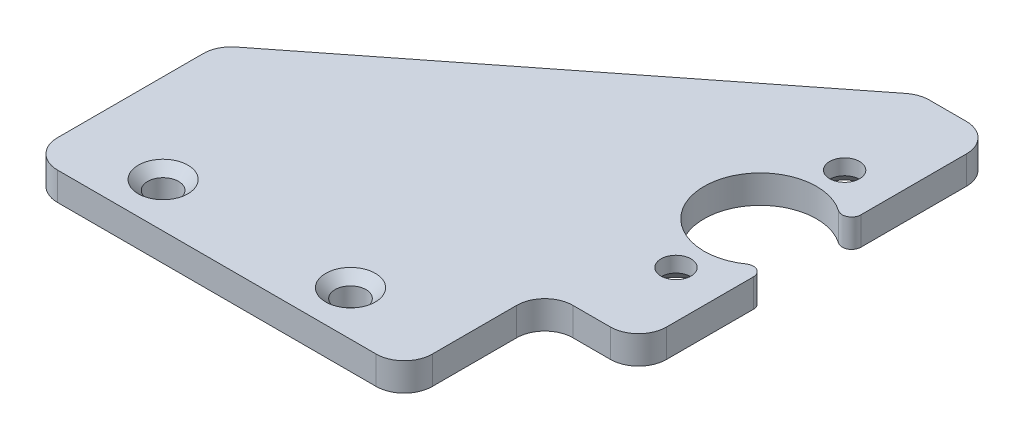
ISO-10303-21;
HEADER;
FILE_DESCRIPTION(('STEP AP214'),'2;1');
FILE_NAME('part.step','',(''),(''),'','','');
FILE_SCHEMA(('AUTOMOTIVE_DESIGN { 1 0 10303 214 1 1 1 1 }'));
ENDSEC;
DATA;
#1=APPLICATION_CONTEXT('core data for automotive mechanical design processes');
#2=APPLICATION_PROTOCOL_DEFINITION('international standard','automotive_design',2000,#1);
#3=PRODUCT_CONTEXT('',#1,'mechanical');
#4=PRODUCT('Part','Part','',(#3));
#5=PRODUCT_RELATED_PRODUCT_CATEGORY('part','',(#4));
#6=PRODUCT_DEFINITION_FORMATION('','',#4);
#7=PRODUCT_DEFINITION_CONTEXT('part definition',#1,'design');
#8=PRODUCT_DEFINITION('design','',#6,#7);
#9=PRODUCT_DEFINITION_SHAPE('','',#8);
#10=(LENGTH_UNIT() NAMED_UNIT(*) SI_UNIT(.MILLI.,.METRE.));
#11=(NAMED_UNIT(*) PLANE_ANGLE_UNIT() SI_UNIT($,.RADIAN.));
#12=(NAMED_UNIT(*) SI_UNIT($,.STERADIAN.) SOLID_ANGLE_UNIT());
#13=UNCERTAINTY_MEASURE_WITH_UNIT(LENGTH_MEASURE(1.E-05),#10,'distance_accuracy_value','');
#14=(GEOMETRIC_REPRESENTATION_CONTEXT(3) GLOBAL_UNCERTAINTY_ASSIGNED_CONTEXT((#13)) GLOBAL_UNIT_ASSIGNED_CONTEXT((#10,
#11,#12)) REPRESENTATION_CONTEXT('',''));
#15=CARTESIAN_POINT('',(0.,0.,0.));
#16=DIRECTION('',(0.,0.,1.));
#17=DIRECTION('',(1.,0.,0.));
#18=AXIS2_PLACEMENT_3D('',#15,#16,#17);
#19=CARTESIAN_POINT('',(0.,3.,-20.));
#20=DIRECTION('',(0.,0.,-1.));
#21=DIRECTION('',(-1.,0.,0.));
#22=AXIS2_PLACEMENT_3D('',#19,#20,#21);
#23=PLANE('',#22);
#24=DIRECTION('',(1.,0.,0.));
#25=VECTOR('',#24,1.);
#26=CARTESIAN_POINT('',(0.,3.,-20.));
#27=LINE('',#26,#25);
#28=CARTESIAN_POINT('',(18.0375892222086,3.,-20.));
#29=VERTEX_POINT('',#28);
#30=CARTESIAN_POINT('',(22.,3.,-20.));
#31=VERTEX_POINT('',#30);
#32=EDGE_CURVE('E406',#29,#31,#27,.T.);
#33=ORIENTED_EDGE('',*,*,#32,.T.);
#34=DIRECTION('',(0.,-1.,0.));
#35=VECTOR('',#34,1.);
#36=CARTESIAN_POINT('',(22.,3.,-20.));
#37=LINE('',#36,#35);
#38=CARTESIAN_POINT('',(22.,0.,-20.));
#39=VERTEX_POINT('',#38);
#40=EDGE_CURVE('E319',#31,#39,#37,.T.);
#41=ORIENTED_EDGE('',*,*,#40,.T.);
#42=DIRECTION('',(1.,0.,0.));
#43=VECTOR('',#42,1.);
#44=CARTESIAN_POINT('',(0.,0.,-20.));
#45=LINE('',#44,#43);
#46=CARTESIAN_POINT('',(18.0375892222086,0.,-20.));
#47=VERTEX_POINT('',#46);
#48=EDGE_CURVE('E182',#47,#39,#45,.T.);
#49=ORIENTED_EDGE('',*,*,#48,.F.);
#50=DIRECTION('',(0.,-1.,0.));
#51=VECTOR('',#50,1.);
#52=CARTESIAN_POINT('',(18.0375892222086,3.,-20.));
#53=LINE('',#52,#51);
#54=EDGE_CURVE('E316',#47,#29,#53,.F.);
#55=ORIENTED_EDGE('',*,*,#54,.T.);
#56=EDGE_LOOP('',(#33,#41,#49,#55));
#57=FACE_BOUND('',#56,.T.);
#58=ADVANCED_FACE('F43',(#57),#23,.T.);
#59=CARTESIAN_POINT('',(-25.,3.,0.));
#60=DIRECTION('',(-1.,0.,0.));
#61=DIRECTION('',(0.,0.,1.));
#62=AXIS2_PLACEMENT_3D('',#59,#60,#61);
#63=PLANE('',#62);
#64=DIRECTION('',(0.,0.,-1.));
#65=VECTOR('',#64,1.);
#66=CARTESIAN_POINT('',(-25.,3.,0.));
#67=LINE('',#66,#65);
#68=CARTESIAN_POINT('',(-25.,3.,30.));
#69=VERTEX_POINT('',#68);
#70=CARTESIAN_POINT('',(-25.,3.,14.4581058174496));
#71=VERTEX_POINT('',#70);
#72=EDGE_CURVE('E387',#69,#71,#67,.T.);
#73=ORIENTED_EDGE('',*,*,#72,.T.);
#74=DIRECTION('',(0.,-1.,0.));
#75=VECTOR('',#74,1.);
#76=CARTESIAN_POINT('',(-25.,3.,14.4581058174496));
#77=LINE('',#76,#75);
#78=CARTESIAN_POINT('',(-25.,0.,14.4581058174496));
#79=VERTEX_POINT('',#78);
#80=EDGE_CURVE('E260',#71,#79,#77,.T.);
#81=ORIENTED_EDGE('',*,*,#80,.T.);
#82=DIRECTION('',(0.,0.,-1.));
#83=VECTOR('',#82,1.);
#84=CARTESIAN_POINT('',(-25.,0.,0.));
#85=LINE('',#84,#83);
#86=CARTESIAN_POINT('',(-25.,0.,30.));
#87=VERTEX_POINT('',#86);
#88=EDGE_CURVE('E210',#87,#79,#85,.T.);
#89=ORIENTED_EDGE('',*,*,#88,.F.);
#90=DIRECTION('',(0.,-1.,0.));
#91=VECTOR('',#90,1.);
#92=CARTESIAN_POINT('',(-25.,3.,30.));
#93=LINE('',#92,#91);
#94=EDGE_CURVE('E257',#87,#69,#93,.F.);
#95=ORIENTED_EDGE('',*,*,#94,.T.);
#96=EDGE_LOOP('',(#73,#81,#89,#95));
#97=FACE_BOUND('',#96,.T.);
#98=ADVANCED_FACE('F385',(#97),#63,.T.);
#99=CARTESIAN_POINT('',(25.,3.,0.));
#100=DIRECTION('',(1.,0.,0.));
#101=DIRECTION('',(0.,0.,-1.));
#102=AXIS2_PLACEMENT_3D('',#99,#100,#101);
#103=PLANE('',#102);
#104=DIRECTION('',(0.,0.,1.));
#105=VECTOR('',#104,1.);
#106=CARTESIAN_POINT('',(25.,3.,0.));
#107=LINE('',#106,#105);
#108=CARTESIAN_POINT('',(25.,3.,5.74456264653803));
#109=VERTEX_POINT('',#108);
#110=CARTESIAN_POINT('',(25.,3.,15.));
#111=VERTEX_POINT('',#110);
#112=EDGE_CURVE('E403',#109,#111,#107,.T.);
#113=ORIENTED_EDGE('',*,*,#112,.T.);
#114=DIRECTION('',(0.,-1.,0.));
#115=VECTOR('',#114,1.);
#116=CARTESIAN_POINT('',(25.,3.,15.));
#117=LINE('',#116,#115);
#118=CARTESIAN_POINT('',(25.,0.,15.));
#119=VERTEX_POINT('',#118);
#120=EDGE_CURVE('E312',#111,#119,#117,.T.);
#121=ORIENTED_EDGE('',*,*,#120,.T.);
#122=DIRECTION('',(0.,0.,1.));
#123=VECTOR('',#122,1.);
#124=CARTESIAN_POINT('',(25.,0.,0.));
#125=LINE('',#124,#123);
#126=CARTESIAN_POINT('',(25.,0.,5.74456264653803));
#127=VERTEX_POINT('',#126);
#128=EDGE_CURVE('E185',#127,#119,#125,.T.);
#129=ORIENTED_EDGE('',*,*,#128,.F.);
#130=DIRECTION('',(0.,-1.,0.));
#131=VECTOR('',#130,1.);
#132=CARTESIAN_POINT('',(25.,3.,5.74456264653803));
#133=LINE('',#132,#131);
#134=EDGE_CURVE('E224',#127,#109,#133,.F.);
#135=ORIENTED_EDGE('',*,*,#134,.T.);
#136=EDGE_LOOP('',(#113,#121,#129,#135));
#137=FACE_BOUND('',#136,.T.);
#138=ADVANCED_FACE('F358',(#137),#103,.T.);
#139=CARTESIAN_POINT('',(0.,3.,0.));
#140=DIRECTION('',(0.,1.,0.));
#141=DIRECTION('',(0.,0.,1.));
#142=AXIS2_PLACEMENT_3D('',#139,#140,#141);
#143=PLANE('',#142);
#144=CARTESIAN_POINT('',(4.5,3.,28.234562646538));
#145=DIRECTION('',(0.,1.,0.));
#146=DIRECTION('',(0.,0.,1.));
#147=AXIS2_PLACEMENT_3D('',#144,#145,#146);
#148=CIRCLE('',#147,2.65000000000001);
#149=CARTESIAN_POINT('',(4.5,3.,30.884562646538));
#150=VERTEX_POINT('',#149);
#151=EDGE_CURVE('E335',#150,#150,#148,.F.);
#152=ORIENTED_EDGE('',*,*,#151,.T.);
#153=EDGE_LOOP('',(#152));
#154=FACE_BOUND('',#153,.T.);
#155=CARTESIAN_POINT('',(-15.5,3.,28.234562646538));
#156=DIRECTION('',(0.,1.,0.));
#157=DIRECTION('',(0.,0.,1.));
#158=AXIS2_PLACEMENT_3D('',#155,#156,#157);
#159=CIRCLE('',#158,2.65000000000001);
#160=CARTESIAN_POINT('',(-15.5,3.,30.884562646538));
#161=VERTEX_POINT('',#160);
#162=EDGE_CURVE('E331',#161,#161,#159,.F.);
#163=ORIENTED_EDGE('',*,*,#162,.T.);
#164=EDGE_LOOP('',(#163));
#165=FACE_BOUND('',#164,.T.);
#166=CARTESIAN_POINT('',(20.,3.,9.));
#167=DIRECTION('',(0.,1.,0.));
#168=DIRECTION('',(0.,0.,1.));
#169=AXIS2_PLACEMENT_3D('',#166,#167,#168);
#170=CIRCLE('',#169,1.6);
#171=CARTESIAN_POINT('',(20.,3.,10.6));
#172=VERTEX_POINT('',#171);
#173=EDGE_CURVE('E207',#172,#172,#170,.T.);
#174=ORIENTED_EDGE('',*,*,#173,.F.);
#175=EDGE_LOOP('',(#174));
#176=FACE_BOUND('',#175,.T.);
#177=CARTESIAN_POINT('',(20.,3.,-9.));
#178=DIRECTION('',(0.,1.,0.));
#179=DIRECTION('',(0.,0.,1.));
#180=AXIS2_PLACEMENT_3D('',#177,#178,#179);
#181=CIRCLE('',#180,1.6);
#182=CARTESIAN_POINT('',(20.,3.,-7.4));
#183=VERTEX_POINT('',#182);
#184=EDGE_CURVE('E201',#183,#183,#181,.T.);
#185=ORIENTED_EDGE('',*,*,#184,.F.);
#186=EDGE_LOOP('',(#185));
#187=FACE_BOUND('',#186,.T.);
#188=DIRECTION('',(0.786318338822423,0.,-0.617821551931904));
#189=VECTOR('',#188,1.);
#190=CARTESIAN_POINT('',(-25.,3.,13.));
#191=LINE('',#190,#189);
#192=CARTESIAN_POINT('',(-23.8534646557957,3.,12.0991508009823));
#193=VERTEX_POINT('',#192);
#194=CARTESIAN_POINT('',(16.1841245664129,3.,-19.3589550164673));
#195=VERTEX_POINT('',#194);
#196=EDGE_CURVE('E367',#193,#195,#191,.T.);
#197=ORIENTED_EDGE('',*,*,#196,.F.);
#198=CARTESIAN_POINT('',(-22.,3.,14.4581058174496));
#199=DIRECTION('',(0.,1.,0.));
#200=DIRECTION('',(0.,0.,1.));
#201=AXIS2_PLACEMENT_3D('',#198,#199,#200);
#202=CIRCLE('',#201,3.);
#203=EDGE_CURVE('E302',#193,#71,#202,.T.);
#204=ORIENTED_EDGE('',*,*,#203,.T.);
#205=ORIENTED_EDGE('',*,*,#72,.F.);
#206=CARTESIAN_POINT('',(-22.,3.,30.));
#207=DIRECTION('',(0.,1.,0.));
#208=DIRECTION('',(0.,0.,1.));
#209=AXIS2_PLACEMENT_3D('',#206,#207,#208);
#210=CIRCLE('',#209,3.);
#211=CARTESIAN_POINT('',(-22.,3.,33.));
#212=VERTEX_POINT('',#211);
#213=EDGE_CURVE('E299',#69,#212,#210,.T.);
#214=ORIENTED_EDGE('',*,*,#213,.T.);
#215=DIRECTION('',(-1.,0.,0.));
#216=VECTOR('',#215,1.);
#217=CARTESIAN_POINT('',(-25.,3.,33.));
#218=LINE('',#217,#216);
#219=CARTESIAN_POINT('',(12.,3.,33.));
#220=VERTEX_POINT('',#219);
#221=EDGE_CURVE('E399',#220,#212,#218,.T.);
#222=ORIENTED_EDGE('',*,*,#221,.F.);
#223=CARTESIAN_POINT('',(12.,3.,30.));
#224=DIRECTION('',(0.,1.,0.));
#225=DIRECTION('',(0.,0.,1.));
#226=AXIS2_PLACEMENT_3D('',#223,#224,#225);
#227=CIRCLE('',#226,3.);
#228=CARTESIAN_POINT('',(15.,3.,30.));
#229=VERTEX_POINT('',#228);
#230=EDGE_CURVE('E296',#220,#229,#227,.T.);
#231=ORIENTED_EDGE('',*,*,#230,.T.);
#232=DIRECTION('',(0.,0.,1.));
#233=VECTOR('',#232,1.);
#234=CARTESIAN_POINT('',(15.,3.,18.));
#235=LINE('',#234,#233);
#236=CARTESIAN_POINT('',(15.,3.,21.));
#237=VERTEX_POINT('',#236);
#238=EDGE_CURVE('E428',#237,#229,#235,.T.);
#239=ORIENTED_EDGE('',*,*,#238,.F.);
#240=CARTESIAN_POINT('',(18.,3.,21.));
#241=DIRECTION('',(0.,1.,0.));
#242=DIRECTION('',(0.,0.,1.));
#243=AXIS2_PLACEMENT_3D('',#240,#241,#242);
#244=CIRCLE('',#243,3.);
#245=CARTESIAN_POINT('',(18.,3.,18.));
#246=VERTEX_POINT('',#245);
#247=EDGE_CURVE('E328',#237,#246,#244,.F.);
#248=ORIENTED_EDGE('',*,*,#247,.T.);
#249=DIRECTION('',(-1.,0.,0.));
#250=VECTOR('',#249,1.);
#251=CARTESIAN_POINT('',(25.,3.,18.));
#252=LINE('',#251,#250);
#253=CARTESIAN_POINT('',(22.,3.,18.));
#254=VERTEX_POINT('',#253);
#255=EDGE_CURVE('E433',#254,#246,#252,.T.);
#256=ORIENTED_EDGE('',*,*,#255,.F.);
#257=CARTESIAN_POINT('',(22.,3.,15.));
#258=DIRECTION('',(0.,1.,0.));
#259=DIRECTION('',(0.,0.,1.));
#260=AXIS2_PLACEMENT_3D('',#257,#258,#259);
#261=CIRCLE('',#260,3.);
#262=EDGE_CURVE('E68',#254,#111,#261,.T.);
#263=ORIENTED_EDGE('',*,*,#262,.T.);
#264=ORIENTED_EDGE('',*,*,#112,.F.);
#265=CARTESIAN_POINT('',(24.,3.,5.74456264653803));
#266=DIRECTION('',(0.,1.,0.));
#267=DIRECTION('',(0.,0.,1.));
#268=AXIS2_PLACEMENT_3D('',#265,#266,#267);
#269=CIRCLE('',#268,1.);
#270=CARTESIAN_POINT('',(23.4285714285714,3.,4.92391083988974));
#271=VERTEX_POINT('',#270);
#272=EDGE_CURVE('E218',#109,#271,#269,.T.);
#273=ORIENTED_EDGE('',*,*,#272,.T.);
#274=CARTESIAN_POINT('',(20.,3.,0.));
#275=DIRECTION('',(0.,1.,0.));
#276=DIRECTION('',(0.,0.,1.));
#277=AXIS2_PLACEMENT_3D('',#274,#275,#276);
#278=CIRCLE('',#277,6.);
#279=CARTESIAN_POINT('',(23.4285714285714,3.,-4.92391083988974));
#280=VERTEX_POINT('',#279);
#281=EDGE_CURVE('E395',#280,#271,#278,.T.);
#282=ORIENTED_EDGE('',*,*,#281,.F.);
#283=CARTESIAN_POINT('',(24.,3.,-5.74456264653803));
#284=DIRECTION('',(0.,1.,0.));
#285=DIRECTION('',(0.,0.,1.));
#286=AXIS2_PLACEMENT_3D('',#283,#284,#285);
#287=CIRCLE('',#286,1.);
#288=CARTESIAN_POINT('',(25.,3.,-5.74456264653803));
#289=VERTEX_POINT('',#288);
#290=EDGE_CURVE('E221',#280,#289,#287,.T.);
#291=ORIENTED_EDGE('',*,*,#290,.T.);
#292=CARTESIAN_POINT('',(25.,3.,-17.));
#293=VERTEX_POINT('',#292);
#294=EDGE_CURVE('E198',#293,#289,#107,.T.);
#295=ORIENTED_EDGE('',*,*,#294,.F.);
#296=CARTESIAN_POINT('',(22.,3.,-17.));
#297=DIRECTION('',(0.,1.,0.));
#298=DIRECTION('',(0.,0.,1.));
#299=AXIS2_PLACEMENT_3D('',#296,#297,#298);
#300=CIRCLE('',#299,3.);
#301=EDGE_CURVE('E291',#293,#31,#300,.T.);
#302=ORIENTED_EDGE('',*,*,#301,.T.);
#303=ORIENTED_EDGE('',*,*,#32,.F.);
#304=CARTESIAN_POINT('',(18.0375892222086,3.,-17.));
#305=DIRECTION('',(0.,1.,0.));
#306=DIRECTION('',(0.,0.,1.));
#307=AXIS2_PLACEMENT_3D('',#304,#305,#306);
#308=CIRCLE('',#307,3.);
#309=EDGE_CURVE('E288',#29,#195,#308,.T.);
#310=ORIENTED_EDGE('',*,*,#309,.T.);
#311=EDGE_LOOP('',(#197,#204,#205,#214,#222,#231,#239,#248,#256,#263,#264,#273,#282,#291,#295,
#302,#303,#310));
#312=FACE_BOUND('',#311,.T.);
#313=ADVANCED_FACE('F355',(#154,#165,#176,#187,#312),#143,.T.);
#314=CARTESIAN_POINT('',(0.,0.,0.));
#315=DIRECTION('',(0.,1.,0.));
#316=DIRECTION('',(0.,0.,1.));
#317=AXIS2_PLACEMENT_3D('',#314,#315,#316);
#318=PLANE('',#317);
#319=CARTESIAN_POINT('',(-5.5,0.,10.234562646538));
#320=DIRECTION('',(0.,1.,0.));
#321=DIRECTION('',(0.,0.,1.));
#322=AXIS2_PLACEMENT_3D('',#319,#320,#321);
#323=CIRCLE('',#322,4.);
#324=CARTESIAN_POINT('',(-5.5,0.,14.234562646538));
#325=VERTEX_POINT('',#324);
#326=EDGE_CURVE('E11',#325,#325,#323,.F.);
#327=ORIENTED_EDGE('',*,*,#326,.F.);
#328=EDGE_LOOP('',(#327));
#329=FACE_BOUND('',#328,.T.);
#330=CARTESIAN_POINT('',(-15.5,0.,28.234562646538));
#331=DIRECTION('',(0.,-1.,0.));
#332=DIRECTION('',(0.,0.,-1.));
#333=AXIS2_PLACEMENT_3D('',#330,#331,#332);
#334=CIRCLE('',#333,1.65);
#335=CARTESIAN_POINT('',(-15.5,0.,26.584562646538));
#336=VERTEX_POINT('',#335);
#337=EDGE_CURVE('E418',#336,#336,#334,.T.);
#338=ORIENTED_EDGE('',*,*,#337,.F.);
#339=EDGE_LOOP('',(#338));
#340=FACE_BOUND('',#339,.T.);
#341=CARTESIAN_POINT('',(4.5,0.,28.234562646538));
#342=DIRECTION('',(0.,-1.,0.));
#343=DIRECTION('',(0.,0.,-1.));
#344=AXIS2_PLACEMENT_3D('',#341,#342,#343);
#345=CIRCLE('',#344,1.65);
#346=CARTESIAN_POINT('',(4.5,0.,26.584562646538));
#347=VERTEX_POINT('',#346);
#348=EDGE_CURVE('E376',#347,#347,#345,.T.);
#349=ORIENTED_EDGE('',*,*,#348,.F.);
#350=EDGE_LOOP('',(#349));
#351=FACE_BOUND('',#350,.T.);
#352=CARTESIAN_POINT('',(20.,0.,-9.));
#353=DIRECTION('',(0.,1.,0.));
#354=DIRECTION('',(0.,0.,1.));
#355=AXIS2_PLACEMENT_3D('',#352,#353,#354);
#356=CIRCLE('',#355,2.94999999999999);
#357=CARTESIAN_POINT('',(20.,0.,-6.05000000000001));
#358=VERTEX_POINT('',#357);
#359=EDGE_CURVE('E231',#358,#358,#356,.T.);
#360=ORIENTED_EDGE('',*,*,#359,.T.);
#361=EDGE_LOOP('',(#360));
#362=FACE_BOUND('',#361,.T.);
#363=CARTESIAN_POINT('',(20.,0.,9.));
#364=DIRECTION('',(0.,1.,0.));
#365=DIRECTION('',(0.,0.,1.));
#366=AXIS2_PLACEMENT_3D('',#363,#364,#365);
#367=CIRCLE('',#366,2.95);
#368=CARTESIAN_POINT('',(20.,0.,11.95));
#369=VERTEX_POINT('',#368);
#370=EDGE_CURVE('E227',#369,#369,#367,.T.);
#371=ORIENTED_EDGE('',*,*,#370,.T.);
#372=EDGE_LOOP('',(#371));
#373=FACE_BOUND('',#372,.T.);
#374=ORIENTED_EDGE('',*,*,#88,.T.);
#375=CARTESIAN_POINT('',(-22.,0.,14.4581058174496));
#376=DIRECTION('',(0.,1.,0.));
#377=DIRECTION('',(0.,0.,1.));
#378=AXIS2_PLACEMENT_3D('',#375,#376,#377);
#379=CIRCLE('',#378,3.);
#380=CARTESIAN_POINT('',(-23.8534646557957,0.,12.0991508009823));
#381=VERTEX_POINT('',#380);
#382=EDGE_CURVE('E278',#79,#381,#379,.F.);
#383=ORIENTED_EDGE('',*,*,#382,.T.);
#384=DIRECTION('',(0.786318338822423,0.,-0.617821551931904));
#385=VECTOR('',#384,1.);
#386=CARTESIAN_POINT('',(-25.,0.,13.));
#387=LINE('',#386,#385);
#388=CARTESIAN_POINT('',(16.1841245664129,0.,-19.3589550164673));
#389=VERTEX_POINT('',#388);
#390=EDGE_CURVE('E377',#381,#389,#387,.T.);
#391=ORIENTED_EDGE('',*,*,#390,.T.);
#392=CARTESIAN_POINT('',(18.0375892222086,0.,-17.));
#393=DIRECTION('',(0.,1.,0.));
#394=DIRECTION('',(0.,0.,1.));
#395=AXIS2_PLACEMENT_3D('',#392,#393,#394);
#396=CIRCLE('',#395,3.);
#397=EDGE_CURVE('E264',#389,#47,#396,.F.);
#398=ORIENTED_EDGE('',*,*,#397,.T.);
#399=ORIENTED_EDGE('',*,*,#48,.T.);
#400=CARTESIAN_POINT('',(22.,0.,-17.));
#401=DIRECTION('',(0.,1.,0.));
#402=DIRECTION('',(0.,0.,1.));
#403=AXIS2_PLACEMENT_3D('',#400,#401,#402);
#404=CIRCLE('',#403,3.);
#405=CARTESIAN_POINT('',(25.,0.,-17.));
#406=VERTEX_POINT('',#405);
#407=EDGE_CURVE('E179',#39,#406,#404,.F.);
#408=ORIENTED_EDGE('',*,*,#407,.T.);
#409=CARTESIAN_POINT('',(25.,0.,-5.74456264653803));
#410=VERTEX_POINT('',#409);
#411=EDGE_CURVE('E171',#406,#410,#125,.T.);
#412=ORIENTED_EDGE('',*,*,#411,.T.);
#413=CARTESIAN_POINT('',(24.,0.,-5.74456264653803));
#414=DIRECTION('',(0.,1.,0.));
#415=DIRECTION('',(0.,0.,1.));
#416=AXIS2_PLACEMENT_3D('',#413,#414,#415);
#417=CIRCLE('',#416,1.);
#418=CARTESIAN_POINT('',(23.4285714285714,0.,-4.92391083988974));
#419=VERTEX_POINT('',#418);
#420=EDGE_CURVE('E176',#410,#419,#417,.F.);
#421=ORIENTED_EDGE('',*,*,#420,.T.);
#422=CARTESIAN_POINT('',(20.,0.,0.));
#423=DIRECTION('',(0.,1.,0.));
#424=DIRECTION('',(0.,0.,1.));
#425=AXIS2_PLACEMENT_3D('',#422,#423,#424);
#426=CIRCLE('',#425,6.);
#427=CARTESIAN_POINT('',(23.4285714285714,0.,4.92391083988974));
#428=VERTEX_POINT('',#427);
#429=EDGE_CURVE('E183',#419,#428,#426,.T.);
#430=ORIENTED_EDGE('',*,*,#429,.T.);
#431=CARTESIAN_POINT('',(24.,0.,5.74456264653803));
#432=DIRECTION('',(0.,1.,0.));
#433=DIRECTION('',(0.,0.,1.));
#434=AXIS2_PLACEMENT_3D('',#431,#432,#433);
#435=CIRCLE('',#434,1.);
#436=EDGE_CURVE('E195',#428,#127,#435,.F.);
#437=ORIENTED_EDGE('',*,*,#436,.T.);
#438=ORIENTED_EDGE('',*,*,#128,.T.);
#439=CARTESIAN_POINT('',(22.,0.,15.));
#440=DIRECTION('',(0.,1.,0.));
#441=DIRECTION('',(0.,0.,1.));
#442=AXIS2_PLACEMENT_3D('',#439,#440,#441);
#443=CIRCLE('',#442,3.);
#444=CARTESIAN_POINT('',(22.,0.,18.));
#445=VERTEX_POINT('',#444);
#446=EDGE_CURVE('E269',#119,#445,#443,.F.);
#447=ORIENTED_EDGE('',*,*,#446,.T.);
#448=DIRECTION('',(-1.,0.,0.));
#449=VECTOR('',#448,1.);
#450=CARTESIAN_POINT('',(25.,0.,18.));
#451=LINE('',#450,#449);
#452=CARTESIAN_POINT('',(18.,0.,18.));
#453=VERTEX_POINT('',#452);
#454=EDGE_CURVE('E432',#445,#453,#451,.T.);
#455=ORIENTED_EDGE('',*,*,#454,.T.);
#456=CARTESIAN_POINT('',(18.,0.,21.));
#457=DIRECTION('',(0.,1.,0.));
#458=DIRECTION('',(0.,0.,1.));
#459=AXIS2_PLACEMENT_3D('',#456,#457,#458);
#460=CIRCLE('',#459,3.);
#461=CARTESIAN_POINT('',(15.,0.,21.));
#462=VERTEX_POINT('',#461);
#463=EDGE_CURVE('E325',#453,#462,#460,.T.);
#464=ORIENTED_EDGE('',*,*,#463,.T.);
#465=DIRECTION('',(0.,0.,1.));
#466=VECTOR('',#465,1.);
#467=CARTESIAN_POINT('',(15.,0.,18.));
#468=LINE('',#467,#466);
#469=CARTESIAN_POINT('',(15.,0.,30.));
#470=VERTEX_POINT('',#469);
#471=EDGE_CURVE('E438',#462,#470,#468,.T.);
#472=ORIENTED_EDGE('',*,*,#471,.T.);
#473=CARTESIAN_POINT('',(12.,0.,30.));
#474=DIRECTION('',(0.,1.,0.));
#475=DIRECTION('',(0.,0.,1.));
#476=AXIS2_PLACEMENT_3D('',#473,#474,#475);
#477=CIRCLE('',#476,3.);
#478=CARTESIAN_POINT('',(12.,0.,33.));
#479=VERTEX_POINT('',#478);
#480=EDGE_CURVE('E272',#470,#479,#477,.F.);
#481=ORIENTED_EDGE('',*,*,#480,.T.);
#482=DIRECTION('',(-1.,0.,0.));
#483=VECTOR('',#482,1.);
#484=CARTESIAN_POINT('',(-25.,0.,33.));
#485=LINE('',#484,#483);
#486=CARTESIAN_POINT('',(-22.,0.,33.));
#487=VERTEX_POINT('',#486);
#488=EDGE_CURVE('E415',#479,#487,#485,.T.);
#489=ORIENTED_EDGE('',*,*,#488,.T.);
#490=CARTESIAN_POINT('',(-22.,0.,30.));
#491=DIRECTION('',(0.,1.,0.));
#492=DIRECTION('',(0.,0.,1.));
#493=AXIS2_PLACEMENT_3D('',#490,#491,#492);
#494=CIRCLE('',#493,3.);
#495=EDGE_CURVE('E275',#487,#87,#494,.F.);
#496=ORIENTED_EDGE('',*,*,#495,.T.);
#497=EDGE_LOOP('',(#374,#383,#391,#398,#399,#408,#412,#421,#430,#437,#438,#447,#455,#464,#472,
#481,#489,#496));
#498=FACE_BOUND('',#497,.T.);
#499=ADVANCED_FACE('F174',(#329,#340,#351,#362,#373,#498),#318,.F.);
#500=CARTESIAN_POINT('',(-25.,3.,33.));
#501=DIRECTION('',(0.,0.,1.));
#502=DIRECTION('',(1.,0.,0.));
#503=AXIS2_PLACEMENT_3D('',#500,#501,#502);
#504=PLANE('',#503);
#505=ORIENTED_EDGE('',*,*,#221,.T.);
#506=DIRECTION('',(0.,-1.,0.));
#507=VECTOR('',#506,1.);
#508=CARTESIAN_POINT('',(-22.,3.,33.));
#509=LINE('',#508,#507);
#510=EDGE_CURVE('E308',#212,#487,#509,.T.);
#511=ORIENTED_EDGE('',*,*,#510,.T.);
#512=ORIENTED_EDGE('',*,*,#488,.F.);
#513=DIRECTION('',(0.,-1.,0.));
#514=VECTOR('',#513,1.);
#515=CARTESIAN_POINT('',(12.,3.,33.));
#516=LINE('',#515,#514);
#517=EDGE_CURVE('E305',#479,#220,#516,.F.);
#518=ORIENTED_EDGE('',*,*,#517,.T.);
#519=EDGE_LOOP('',(#505,#511,#512,#518));
#520=FACE_BOUND('',#519,.T.);
#521=ADVANCED_FACE('F460',(#520),#504,.T.);
#522=CARTESIAN_POINT('',(20.,3.,0.));
#523=DIRECTION('',(0.,-1.,0.));
#524=DIRECTION('',(0.,0.,-1.));
#525=AXIS2_PLACEMENT_3D('',#522,#523,#524);
#526=CYLINDRICAL_SURFACE('',#525,6.);
#527=ORIENTED_EDGE('',*,*,#429,.F.);
#528=DIRECTION('',(0.,-1.,0.));
#529=VECTOR('',#528,1.);
#530=CARTESIAN_POINT('',(23.4285714285714,3.,-4.92391083988974));
#531=LINE('',#530,#529);
#532=EDGE_CURVE('E192',#419,#280,#531,.F.);
#533=ORIENTED_EDGE('',*,*,#532,.T.);
#534=ORIENTED_EDGE('',*,*,#281,.T.);
#535=DIRECTION('',(0.,-1.,0.));
#536=VECTOR('',#535,1.);
#537=CARTESIAN_POINT('',(23.4285714285714,3.,4.92391083988974));
#538=LINE('',#537,#536);
#539=EDGE_CURVE('E194',#271,#428,#538,.T.);
#540=ORIENTED_EDGE('',*,*,#539,.T.);
#541=EDGE_LOOP('',(#527,#533,#534,#540));
#542=FACE_BOUND('',#541,.T.);
#543=ADVANCED_FACE('F497',(#542),#526,.F.);
#544=ORIENTED_EDGE('',*,*,#411,.F.);
#545=DIRECTION('',(0.,-1.,0.));
#546=VECTOR('',#545,1.);
#547=CARTESIAN_POINT('',(25.,3.,-17.));
#548=LINE('',#547,#546);
#549=EDGE_CURVE('E60',#406,#293,#548,.F.);
#550=ORIENTED_EDGE('',*,*,#549,.T.);
#551=ORIENTED_EDGE('',*,*,#294,.T.);
#552=DIRECTION('',(0.,-1.,0.));
#553=VECTOR('',#552,1.);
#554=CARTESIAN_POINT('',(25.,3.,-5.74456264653803));
#555=LINE('',#554,#553);
#556=EDGE_CURVE('E191',#289,#410,#555,.T.);
#557=ORIENTED_EDGE('',*,*,#556,.T.);
#558=EDGE_LOOP('',(#544,#550,#551,#557));
#559=FACE_BOUND('',#558,.T.);
#560=ADVANCED_FACE('F197',(#559),#103,.T.);
#561=CARTESIAN_POINT('',(20.,3.,9.));
#562=DIRECTION('',(0.,-1.,0.));
#563=DIRECTION('',(0.,0.,-1.));
#564=AXIS2_PLACEMENT_3D('',#561,#562,#563);
#565=CYLINDRICAL_SURFACE('',#564,1.6);
#566=CARTESIAN_POINT('',(20.,1.35,9.));
#567=DIRECTION('',(0.,1.,0.));
#568=DIRECTION('',(0.,0.,1.));
#569=AXIS2_PLACEMENT_3D('',#566,#567,#568);
#570=CIRCLE('',#569,1.6);
#571=CARTESIAN_POINT('',(20.,1.35,10.6));
#572=VERTEX_POINT('',#571);
#573=EDGE_CURVE('E239',#572,#572,#570,.F.);
#574=ORIENTED_EDGE('',*,*,#573,.T.);
#575=EDGE_LOOP('',(#574));
#576=FACE_BOUND('',#575,.T.);
#577=ORIENTED_EDGE('',*,*,#173,.T.);
#578=EDGE_LOOP('',(#577));
#579=FACE_BOUND('',#578,.T.);
#580=ADVANCED_FACE('F586',(#576,#579),#565,.F.);
#581=CARTESIAN_POINT('',(20.,3.,-9.));
#582=DIRECTION('',(0.,-1.,0.));
#583=DIRECTION('',(0.,0.,-1.));
#584=AXIS2_PLACEMENT_3D('',#581,#582,#583);
#585=CYLINDRICAL_SURFACE('',#584,1.6);
#586=CARTESIAN_POINT('',(20.,1.35,-9.));
#587=DIRECTION('',(0.,1.,0.));
#588=DIRECTION('',(0.,0.,1.));
#589=AXIS2_PLACEMENT_3D('',#586,#587,#588);
#590=CIRCLE('',#589,1.6);
#591=CARTESIAN_POINT('',(20.,1.35,-7.4));
#592=VERTEX_POINT('',#591);
#593=EDGE_CURVE('E235',#592,#592,#590,.F.);
#594=ORIENTED_EDGE('',*,*,#593,.T.);
#595=EDGE_LOOP('',(#594));
#596=FACE_BOUND('',#595,.T.);
#597=ORIENTED_EDGE('',*,*,#184,.T.);
#598=EDGE_LOOP('',(#597));
#599=FACE_BOUND('',#598,.T.);
#600=ADVANCED_FACE('F503',(#596,#599),#585,.F.);
#601=CARTESIAN_POINT('',(24.,3.,-5.74456264653803));
#602=DIRECTION('',(0.,-1.,0.));
#603=DIRECTION('',(0.,0.,-1.));
#604=AXIS2_PLACEMENT_3D('',#601,#602,#603);
#605=CYLINDRICAL_SURFACE('',#604,1.);
#606=ORIENTED_EDGE('',*,*,#290,.F.);
#607=ORIENTED_EDGE('',*,*,#532,.F.);
#608=ORIENTED_EDGE('',*,*,#420,.F.);
#609=ORIENTED_EDGE('',*,*,#556,.F.);
#610=EDGE_LOOP('',(#606,#607,#608,#609));
#611=FACE_BOUND('',#610,.T.);
#612=ADVANCED_FACE('F190',(#611),#605,.T.);
#613=CARTESIAN_POINT('',(24.,3.,5.74456264653803));
#614=DIRECTION('',(0.,-1.,0.));
#615=DIRECTION('',(0.,0.,-1.));
#616=AXIS2_PLACEMENT_3D('',#613,#614,#615);
#617=CYLINDRICAL_SURFACE('',#616,1.);
#618=ORIENTED_EDGE('',*,*,#272,.F.);
#619=ORIENTED_EDGE('',*,*,#134,.F.);
#620=ORIENTED_EDGE('',*,*,#436,.F.);
#621=ORIENTED_EDGE('',*,*,#539,.F.);
#622=EDGE_LOOP('',(#618,#619,#620,#621));
#623=FACE_BOUND('',#622,.T.);
#624=ADVANCED_FACE('F482',(#623),#617,.T.);
#625=CARTESIAN_POINT('',(20.,0.,-9.));
#626=DIRECTION('',(0.,-1.,0.));
#627=DIRECTION('',(0.,0.,-1.));
#628=AXIS2_PLACEMENT_3D('',#625,#626,#627);
#629=CONICAL_SURFACE('',#628,2.94999999999999,0.785398163397445);
#630=ORIENTED_EDGE('',*,*,#593,.F.);
#631=EDGE_LOOP('',(#630));
#632=FACE_BOUND('',#631,.T.);
#633=ORIENTED_EDGE('',*,*,#359,.F.);
#634=EDGE_LOOP('',(#633));
#635=FACE_BOUND('',#634,.T.);
#636=ADVANCED_FACE('F473',(#632,#635),#629,.F.);
#637=CARTESIAN_POINT('',(20.,0.,9.));
#638=DIRECTION('',(0.,-1.,0.));
#639=DIRECTION('',(0.,0.,-1.));
#640=AXIS2_PLACEMENT_3D('',#637,#638,#639);
#641=CONICAL_SURFACE('',#640,2.95,0.785398163397447);
#642=ORIENTED_EDGE('',*,*,#573,.F.);
#643=EDGE_LOOP('',(#642));
#644=FACE_BOUND('',#643,.T.);
#645=ORIENTED_EDGE('',*,*,#370,.F.);
#646=EDGE_LOOP('',(#645));
#647=FACE_BOUND('',#646,.T.);
#648=ADVANCED_FACE('F470',(#644,#647),#641,.F.);
#649=CARTESIAN_POINT('',(4.5,3.,28.234562646538));
#650=DIRECTION('',(0.,-1.,0.));
#651=DIRECTION('',(0.,0.,-1.));
#652=AXIS2_PLACEMENT_3D('',#649,#650,#651);
#653=CYLINDRICAL_SURFACE('',#652,1.65);
#654=CARTESIAN_POINT('',(4.5,1.99999999999999,28.234562646538));
#655=DIRECTION('',(0.,1.,0.));
#656=DIRECTION('',(0.,0.,1.));
#657=AXIS2_PLACEMENT_3D('',#654,#655,#656);
#658=CIRCLE('',#657,1.65);
#659=CARTESIAN_POINT('',(4.5,1.99999999999999,29.884562646538));
#660=VERTEX_POINT('',#659);
#661=EDGE_CURVE('E339',#660,#660,#658,.T.);
#662=ORIENTED_EDGE('',*,*,#661,.T.);
#663=EDGE_LOOP('',(#662));
#664=FACE_BOUND('',#663,.T.);
#665=ORIENTED_EDGE('',*,*,#348,.T.);
#666=EDGE_LOOP('',(#665));
#667=FACE_BOUND('',#666,.T.);
#668=ADVANCED_FACE('F472',(#664,#667),#653,.F.);
#669=CARTESIAN_POINT('',(-15.5,3.,28.234562646538));
#670=DIRECTION('',(0.,-1.,0.));
#671=DIRECTION('',(0.,0.,-1.));
#672=AXIS2_PLACEMENT_3D('',#669,#670,#671);
#673=CYLINDRICAL_SURFACE('',#672,1.65);
#674=CARTESIAN_POINT('',(-15.5,1.99999999999999,28.234562646538));
#675=DIRECTION('',(0.,1.,0.));
#676=DIRECTION('',(0.,0.,1.));
#677=AXIS2_PLACEMENT_3D('',#674,#675,#676);
#678=CIRCLE('',#677,1.65);
#679=CARTESIAN_POINT('',(-15.5,1.99999999999999,29.884562646538));
#680=VERTEX_POINT('',#679);
#681=EDGE_CURVE('E53',#680,#680,#678,.T.);
#682=ORIENTED_EDGE('',*,*,#681,.T.);
#683=EDGE_LOOP('',(#682));
#684=FACE_BOUND('',#683,.T.);
#685=ORIENTED_EDGE('',*,*,#337,.T.);
#686=EDGE_LOOP('',(#685));
#687=FACE_BOUND('',#686,.T.);
#688=ADVANCED_FACE('F346',(#684,#687),#673,.F.);
#689=CARTESIAN_POINT('',(15.,3.,18.));
#690=DIRECTION('',(1.,0.,0.));
#691=DIRECTION('',(0.,0.,-1.));
#692=AXIS2_PLACEMENT_3D('',#689,#690,#691);
#693=PLANE('',#692);
#694=ORIENTED_EDGE('',*,*,#471,.F.);
#695=DIRECTION('',(0.,-1.,0.));
#696=VECTOR('',#695,1.);
#697=CARTESIAN_POINT('',(15.,3.,21.));
#698=LINE('',#697,#696);
#699=EDGE_CURVE('E254',#462,#237,#698,.F.);
#700=ORIENTED_EDGE('',*,*,#699,.T.);
#701=ORIENTED_EDGE('',*,*,#238,.T.);
#702=DIRECTION('',(0.,-1.,0.));
#703=VECTOR('',#702,1.);
#704=CARTESIAN_POINT('',(15.,3.,30.));
#705=LINE('',#704,#703);
#706=EDGE_CURVE('E250',#229,#470,#705,.T.);
#707=ORIENTED_EDGE('',*,*,#706,.T.);
#708=EDGE_LOOP('',(#694,#700,#701,#707));
#709=FACE_BOUND('',#708,.T.);
#710=ADVANCED_FACE('F569',(#709),#693,.T.);
#711=CARTESIAN_POINT('',(25.,3.,18.));
#712=DIRECTION('',(0.,0.,1.));
#713=DIRECTION('',(1.,0.,0.));
#714=AXIS2_PLACEMENT_3D('',#711,#712,#713);
#715=PLANE('',#714);
#716=ORIENTED_EDGE('',*,*,#255,.T.);
#717=DIRECTION('',(0.,-1.,0.));
#718=VECTOR('',#717,1.);
#719=CARTESIAN_POINT('',(18.,0.,18.));
#720=LINE('',#719,#718);
#721=EDGE_CURVE('E246',#246,#453,#720,.T.);
#722=ORIENTED_EDGE('',*,*,#721,.T.);
#723=ORIENTED_EDGE('',*,*,#454,.F.);
#724=DIRECTION('',(0.,-1.,0.));
#725=VECTOR('',#724,1.);
#726=CARTESIAN_POINT('',(22.,3.,18.));
#727=LINE('',#726,#725);
#728=EDGE_CURVE('E243',#445,#254,#727,.F.);
#729=ORIENTED_EDGE('',*,*,#728,.T.);
#730=EDGE_LOOP('',(#716,#722,#723,#729));
#731=FACE_BOUND('',#730,.T.);
#732=ADVANCED_FACE('F547',(#731),#715,.T.);
#733=CARTESIAN_POINT('',(-25.,3.,13.));
#734=DIRECTION('',(-0.617821551931904,0.,-0.786318338822423));
#735=DIRECTION('',(-0.786318338822423,0.,0.617821551931904));
#736=AXIS2_PLACEMENT_3D('',#733,#734,#735);
#737=PLANE('',#736);
#738=ORIENTED_EDGE('',*,*,#390,.F.);
#739=DIRECTION('',(0.,-1.,0.));
#740=VECTOR('',#739,1.);
#741=CARTESIAN_POINT('',(-23.8534646557957,3.,12.0991508009823));
#742=LINE('',#741,#740);
#743=EDGE_CURVE('E285',#381,#193,#742,.F.);
#744=ORIENTED_EDGE('',*,*,#743,.T.);
#745=ORIENTED_EDGE('',*,*,#196,.T.);
#746=DIRECTION('',(0.,-1.,0.));
#747=VECTOR('',#746,1.);
#748=CARTESIAN_POINT('',(16.1841245664129,3.,-19.3589550164673));
#749=LINE('',#748,#747);
#750=EDGE_CURVE('E281',#195,#389,#749,.T.);
#751=ORIENTED_EDGE('',*,*,#750,.T.);
#752=EDGE_LOOP('',(#738,#744,#745,#751));
#753=FACE_BOUND('',#752,.T.);
#754=ADVANCED_FACE('F542',(#753),#737,.T.);
#755=CARTESIAN_POINT('',(18.,3.,21.));
#756=DIRECTION('',(0.,1.,0.));
#757=DIRECTION('',(0.,0.,1.));
#758=AXIS2_PLACEMENT_3D('',#755,#756,#757);
#759=CYLINDRICAL_SURFACE('',#758,3.);
#760=ORIENTED_EDGE('',*,*,#247,.F.);
#761=ORIENTED_EDGE('',*,*,#699,.F.);
#762=ORIENTED_EDGE('',*,*,#463,.F.);
#763=ORIENTED_EDGE('',*,*,#721,.F.);
#764=EDGE_LOOP('',(#760,#761,#762,#763));
#765=FACE_BOUND('',#764,.T.);
#766=ADVANCED_FACE('F540',(#765),#759,.F.);
#767=CARTESIAN_POINT('',(-22.,3.,14.4581058174496));
#768=DIRECTION('',(0.,-1.,0.));
#769=DIRECTION('',(0.,0.,-1.));
#770=AXIS2_PLACEMENT_3D('',#767,#768,#769);
#771=CYLINDRICAL_SURFACE('',#770,3.);
#772=ORIENTED_EDGE('',*,*,#203,.F.);
#773=ORIENTED_EDGE('',*,*,#743,.F.);
#774=ORIENTED_EDGE('',*,*,#382,.F.);
#775=ORIENTED_EDGE('',*,*,#80,.F.);
#776=EDGE_LOOP('',(#772,#773,#774,#775));
#777=FACE_BOUND('',#776,.T.);
#778=ADVANCED_FACE('F382',(#777),#771,.T.);
#779=CARTESIAN_POINT('',(-22.,3.,30.));
#780=DIRECTION('',(0.,-1.,0.));
#781=DIRECTION('',(0.,0.,-1.));
#782=AXIS2_PLACEMENT_3D('',#779,#780,#781);
#783=CYLINDRICAL_SURFACE('',#782,3.);
#784=ORIENTED_EDGE('',*,*,#213,.F.);
#785=ORIENTED_EDGE('',*,*,#94,.F.);
#786=ORIENTED_EDGE('',*,*,#495,.F.);
#787=ORIENTED_EDGE('',*,*,#510,.F.);
#788=EDGE_LOOP('',(#784,#785,#786,#787));
#789=FACE_BOUND('',#788,.T.);
#790=ADVANCED_FACE('F534',(#789),#783,.T.);
#791=CARTESIAN_POINT('',(12.,3.,30.));
#792=DIRECTION('',(0.,-1.,0.));
#793=DIRECTION('',(0.,0.,-1.));
#794=AXIS2_PLACEMENT_3D('',#791,#792,#793);
#795=CYLINDRICAL_SURFACE('',#794,3.);
#796=ORIENTED_EDGE('',*,*,#230,.F.);
#797=ORIENTED_EDGE('',*,*,#517,.F.);
#798=ORIENTED_EDGE('',*,*,#480,.F.);
#799=ORIENTED_EDGE('',*,*,#706,.F.);
#800=EDGE_LOOP('',(#796,#797,#798,#799));
#801=FACE_BOUND('',#800,.T.);
#802=ADVANCED_FACE('F530',(#801),#795,.T.);
#803=CARTESIAN_POINT('',(22.,3.,15.));
#804=DIRECTION('',(0.,-1.,0.));
#805=DIRECTION('',(0.,0.,-1.));
#806=AXIS2_PLACEMENT_3D('',#803,#804,#805);
#807=CYLINDRICAL_SURFACE('',#806,3.);
#808=ORIENTED_EDGE('',*,*,#262,.F.);
#809=ORIENTED_EDGE('',*,*,#728,.F.);
#810=ORIENTED_EDGE('',*,*,#446,.F.);
#811=ORIENTED_EDGE('',*,*,#120,.F.);
#812=EDGE_LOOP('',(#808,#809,#810,#811));
#813=FACE_BOUND('',#812,.T.);
#814=ADVANCED_FACE('F526',(#813),#807,.T.);
#815=CARTESIAN_POINT('',(22.,3.,-17.));
#816=DIRECTION('',(0.,-1.,0.));
#817=DIRECTION('',(0.,0.,-1.));
#818=AXIS2_PLACEMENT_3D('',#815,#816,#817);
#819=CYLINDRICAL_SURFACE('',#818,3.);
#820=ORIENTED_EDGE('',*,*,#301,.F.);
#821=ORIENTED_EDGE('',*,*,#549,.F.);
#822=ORIENTED_EDGE('',*,*,#407,.F.);
#823=ORIENTED_EDGE('',*,*,#40,.F.);
#824=EDGE_LOOP('',(#820,#821,#822,#823));
#825=FACE_BOUND('',#824,.T.);
#826=ADVANCED_FACE('F522',(#825),#819,.T.);
#827=CARTESIAN_POINT('',(18.0375892222086,3.,-17.));
#828=DIRECTION('',(0.,-1.,0.));
#829=DIRECTION('',(0.,0.,-1.));
#830=AXIS2_PLACEMENT_3D('',#827,#828,#829);
#831=CYLINDRICAL_SURFACE('',#830,3.);
#832=ORIENTED_EDGE('',*,*,#309,.F.);
#833=ORIENTED_EDGE('',*,*,#54,.F.);
#834=ORIENTED_EDGE('',*,*,#397,.F.);
#835=ORIENTED_EDGE('',*,*,#750,.F.);
#836=EDGE_LOOP('',(#832,#833,#834,#835));
#837=FACE_BOUND('',#836,.T.);
#838=ADVANCED_FACE('F518',(#837),#831,.T.);
#839=CARTESIAN_POINT('',(4.5,3.,28.234562646538));
#840=DIRECTION('',(0.,1.,0.));
#841=DIRECTION('',(0.,0.,1.));
#842=AXIS2_PLACEMENT_3D('',#839,#840,#841);
#843=CONICAL_SURFACE('',#842,2.65000000000001,0.785398163397446);
#844=ORIENTED_EDGE('',*,*,#661,.F.);
#845=EDGE_LOOP('',(#844));
#846=FACE_BOUND('',#845,.T.);
#847=ORIENTED_EDGE('',*,*,#151,.F.);
#848=EDGE_LOOP('',(#847));
#849=FACE_BOUND('',#848,.T.);
#850=ADVANCED_FACE('F352',(#846,#849),#843,.F.);
#851=CARTESIAN_POINT('',(-15.5,3.,28.234562646538));
#852=DIRECTION('',(0.,1.,0.));
#853=DIRECTION('',(0.,0.,1.));
#854=AXIS2_PLACEMENT_3D('',#851,#852,#853);
#855=CONICAL_SURFACE('',#854,2.65000000000001,0.785398163397446);
#856=ORIENTED_EDGE('',*,*,#681,.F.);
#857=EDGE_LOOP('',(#856));
#858=FACE_BOUND('',#857,.T.);
#859=ORIENTED_EDGE('',*,*,#162,.F.);
#860=EDGE_LOOP('',(#859));
#861=FACE_BOUND('',#860,.T.);
#862=ADVANCED_FACE('F46',(#858,#861),#855,.F.);
#863=CARTESIAN_POINT('',(-5.5,-8.,10.234562646538));
#864=DIRECTION('',(0.,1.,0.));
#865=DIRECTION('',(0.,0.,1.));
#866=AXIS2_PLACEMENT_3D('',#863,#864,#865);
#867=CYLINDRICAL_SURFACE('',#866,4.);
#868=CARTESIAN_POINT('',(-5.5,-8.,10.234562646538));
#869=DIRECTION('',(0.,-1.,0.));
#870=DIRECTION('',(0.,0.,-1.));
#871=AXIS2_PLACEMENT_3D('',#868,#869,#870);
#872=CIRCLE('',#871,4.);
#873=CARTESIAN_POINT('',(-5.5,-8.,6.23456264653802));
#874=VERTEX_POINT('',#873);
#875=EDGE_CURVE('E437',#874,#874,#872,.T.);
#876=ORIENTED_EDGE('',*,*,#875,.F.);
#877=EDGE_LOOP('',(#876));
#878=FACE_BOUND('',#877,.T.);
#879=ORIENTED_EDGE('',*,*,#326,.T.);
#880=EDGE_LOOP('',(#879));
#881=FACE_BOUND('',#880,.T.);
#882=ADVANCED_FACE('F351',(#878,#881),#867,.T.);
#883=CARTESIAN_POINT('',(-5.5,-8.,10.234562646538));
#884=DIRECTION('',(0.,-1.,0.));
#885=DIRECTION('',(0.,0.,-1.));
#886=AXIS2_PLACEMENT_3D('',#883,#884,#885);
#887=PLANE('',#886);
#888=ORIENTED_EDGE('',*,*,#875,.T.);
#889=EDGE_LOOP('',(#888));
#890=FACE_BOUND('',#889,.T.);
#891=ADVANCED_FACE('F451',(#890),#887,.T.);
#892=CLOSED_SHELL('',(#58,#98,#138,#313,#499,#521,#543,#560,#580,#600,#612,#624,#636,#648,#668,
#688,#710,#732,#754,#766,#778,#790,#802,#814,#826,#838,#850,#862,#882,#891));
#893=MANIFOLD_SOLID_BREP('B2',#892);
#894=ADVANCED_BREP_SHAPE_REPRESENTATION('',(#18,#893),#14);
#895=SHAPE_DEFINITION_REPRESENTATION(#9,#894);
ENDSEC;
END-ISO-10303-21;
